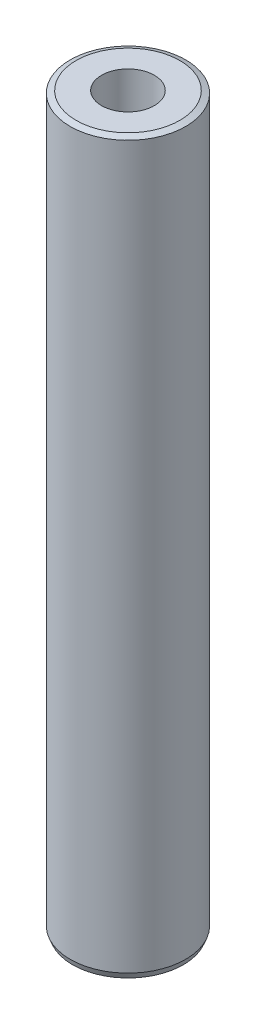
ISO-10303-21;
HEADER;
FILE_DESCRIPTION(('STEP AP214'),'2;1');
FILE_NAME('part.step','',(''),(''),'','','');
FILE_SCHEMA(('AUTOMOTIVE_DESIGN { 1 0 10303 214 1 1 1 1 }'));
ENDSEC;
DATA;
#1=APPLICATION_CONTEXT('core data for automotive mechanical design processes');
#2=APPLICATION_PROTOCOL_DEFINITION('international standard','automotive_design',2000,#1);
#3=PRODUCT_CONTEXT('',#1,'mechanical');
#4=PRODUCT('Part','Part','',(#3));
#5=PRODUCT_RELATED_PRODUCT_CATEGORY('part','',(#4));
#6=PRODUCT_DEFINITION_FORMATION('','',#4);
#7=PRODUCT_DEFINITION_CONTEXT('part definition',#1,'design');
#8=PRODUCT_DEFINITION('design','',#6,#7);
#9=PRODUCT_DEFINITION_SHAPE('','',#8);
#10=(LENGTH_UNIT() NAMED_UNIT(*) SI_UNIT(.MILLI.,.METRE.));
#11=(NAMED_UNIT(*) PLANE_ANGLE_UNIT() SI_UNIT($,.RADIAN.));
#12=(NAMED_UNIT(*) SI_UNIT($,.STERADIAN.) SOLID_ANGLE_UNIT());
#13=UNCERTAINTY_MEASURE_WITH_UNIT(LENGTH_MEASURE(1.E-05),#10,'distance_accuracy_value','');
#14=(GEOMETRIC_REPRESENTATION_CONTEXT(3) GLOBAL_UNCERTAINTY_ASSIGNED_CONTEXT((#13)) GLOBAL_UNIT_ASSIGNED_CONTEXT((#10,
#11,#12)) REPRESENTATION_CONTEXT('',''));
#15=CARTESIAN_POINT('',(0.,0.,0.));
#16=DIRECTION('',(0.,0.,1.));
#17=DIRECTION('',(1.,0.,0.));
#18=AXIS2_PLACEMENT_3D('',#15,#16,#17);
#19=CARTESIAN_POINT('',(0.,600.,0.));
#20=DIRECTION('',(0.,-1.,0.));
#21=DIRECTION('',(0.,0.,-1.));
#22=AXIS2_PLACEMENT_3D('',#19,#20,#21);
#23=CYLINDRICAL_SURFACE('',#22,47.5);
#24=CARTESIAN_POINT('',(0.,598.071272281347,0.));
#25=DIRECTION('',(0.,1.,0.));
#26=DIRECTION('',(0.,0.,1.));
#27=AXIS2_PLACEMENT_3D('',#24,#25,#26);
#28=CIRCLE('',#27,47.5);
#29=CARTESIAN_POINT('',(0.,598.071272281347,47.5));
#30=VERTEX_POINT('',#29);
#31=EDGE_CURVE('E50',#30,#30,#28,.F.);
#32=ORIENTED_EDGE('',*,*,#31,.T.);
#33=EDGE_LOOP('',(#32));
#34=FACE_BOUND('',#33,.T.);
#35=CARTESIAN_POINT('',(0.,4.83887665642557,0.));
#36=DIRECTION('',(0.,1.,0.));
#37=DIRECTION('',(0.,0.,1.));
#38=AXIS2_PLACEMENT_3D('',#35,#36,#37);
#39=CIRCLE('',#38,47.5);
#40=CARTESIAN_POINT('',(0.,4.83887665642557,47.5));
#41=VERTEX_POINT('',#40);
#42=EDGE_CURVE('E51',#41,#41,#39,.T.);
#43=ORIENTED_EDGE('',*,*,#42,.T.);
#44=EDGE_LOOP('',(#43));
#45=FACE_BOUND('',#44,.T.);
#46=ADVANCED_FACE('F39',(#34,#45),#23,.T.);
#47=CARTESIAN_POINT('',(0.,600.,0.));
#48=DIRECTION('',(0.,1.,0.));
#49=DIRECTION('',(0.,0.,1.));
#50=AXIS2_PLACEMENT_3D('',#47,#48,#49);
#51=PLANE('',#50);
#52=CARTESIAN_POINT('',(0.,600.,0.));
#53=DIRECTION('',(0.,1.,0.));
#54=DIRECTION('',(0.,0.,1.));
#55=AXIS2_PLACEMENT_3D('',#52,#53,#54);
#56=CIRCLE('',#55,42.661123343574);
#57=CARTESIAN_POINT('',(0.,600.,42.661123343574));
#58=VERTEX_POINT('',#57);
#59=EDGE_CURVE('E54',#58,#58,#56,.T.);
#60=ORIENTED_EDGE('',*,*,#59,.T.);
#61=EDGE_LOOP('',(#60));
#62=FACE_BOUND('',#61,.T.);
#63=CARTESIAN_POINT('',(0.,600.,0.));
#64=DIRECTION('',(0.,1.,0.));
#65=DIRECTION('',(0.,0.,1.));
#66=AXIS2_PLACEMENT_3D('',#63,#64,#65);
#67=CIRCLE('',#66,21.7029122122501);
#68=CARTESIAN_POINT('',(0.,600.,21.7029122122501));
#69=VERTEX_POINT('',#68);
#70=EDGE_CURVE('E58',#69,#69,#67,.T.);
#71=ORIENTED_EDGE('',*,*,#70,.F.);
#72=EDGE_LOOP('',(#71));
#73=FACE_BOUND('',#72,.T.);
#74=ADVANCED_FACE('F69',(#62,#73),#51,.T.);
#75=CARTESIAN_POINT('',(0.,0.,0.));
#76=DIRECTION('',(0.,1.,0.));
#77=DIRECTION('',(0.,0.,1.));
#78=AXIS2_PLACEMENT_3D('',#75,#76,#77);
#79=PLANE('',#78);
#80=CARTESIAN_POINT('',(0.,0.,0.));
#81=DIRECTION('',(0.,1.,0.));
#82=DIRECTION('',(0.,0.,1.));
#83=AXIS2_PLACEMENT_3D('',#80,#81,#82);
#84=CIRCLE('',#83,45.5712722813468);
#85=CARTESIAN_POINT('',(0.,0.,45.5712722813468));
#86=VERTEX_POINT('',#85);
#87=EDGE_CURVE('E10',#86,#86,#84,.F.);
#88=ORIENTED_EDGE('',*,*,#87,.T.);
#89=EDGE_LOOP('',(#88));
#90=FACE_BOUND('',#89,.T.);
#91=CARTESIAN_POINT('',(0.,0.,0.));
#92=DIRECTION('',(0.,1.,0.));
#93=DIRECTION('',(0.,0.,1.));
#94=AXIS2_PLACEMENT_3D('',#91,#92,#93);
#95=CIRCLE('',#94,21.7029122122501);
#96=CARTESIAN_POINT('',(0.,0.,21.7029122122501));
#97=VERTEX_POINT('',#96);
#98=EDGE_CURVE('E63',#97,#97,#95,.T.);
#99=ORIENTED_EDGE('',*,*,#98,.T.);
#100=EDGE_LOOP('',(#99));
#101=FACE_BOUND('',#100,.T.);
#102=ADVANCED_FACE('F75',(#90,#101),#79,.F.);
#103=CARTESIAN_POINT('',(0.,600.,0.));
#104=DIRECTION('',(0.,-1.,0.));
#105=DIRECTION('',(0.,0.,-1.));
#106=AXIS2_PLACEMENT_3D('',#103,#104,#105);
#107=CYLINDRICAL_SURFACE('',#106,21.7029122122501);
#108=ORIENTED_EDGE('',*,*,#70,.T.);
#109=EDGE_LOOP('',(#108));
#110=FACE_BOUND('',#109,.T.);
#111=ORIENTED_EDGE('',*,*,#98,.F.);
#112=EDGE_LOOP('',(#111));
#113=FACE_BOUND('',#112,.T.);
#114=ADVANCED_FACE('F70',(#110,#113),#107,.F.);
#115=CARTESIAN_POINT('',(0.,600.,0.));
#116=DIRECTION('',(0.,-1.,0.));
#117=DIRECTION('',(0.,0.,-1.));
#118=AXIS2_PLACEMENT_3D('',#115,#116,#117);
#119=CONICAL_SURFACE('',#118,42.661123343574,1.19150608040067);
#120=ORIENTED_EDGE('',*,*,#31,.F.);
#121=EDGE_LOOP('',(#120));
#122=FACE_BOUND('',#121,.T.);
#123=ORIENTED_EDGE('',*,*,#59,.F.);
#124=EDGE_LOOP('',(#123));
#125=FACE_BOUND('',#124,.T.);
#126=ADVANCED_FACE('F81',(#122,#125),#119,.T.);
#127=CARTESIAN_POINT('',(0.,4.83887665642557,0.));
#128=DIRECTION('',(0.,1.,0.));
#129=DIRECTION('',(0.,0.,1.));
#130=AXIS2_PLACEMENT_3D('',#127,#128,#129);
#131=CONICAL_SURFACE('',#130,47.5,0.37929024639423);
#132=ORIENTED_EDGE('',*,*,#87,.F.);
#133=EDGE_LOOP('',(#132));
#134=FACE_BOUND('',#133,.T.);
#135=ORIENTED_EDGE('',*,*,#42,.F.);
#136=EDGE_LOOP('',(#135));
#137=FACE_BOUND('',#136,.T.);
#138=ADVANCED_FACE('F45',(#134,#137),#131,.T.);
#139=CLOSED_SHELL('',(#46,#74,#102,#114,#126,#138));
#140=MANIFOLD_SOLID_BREP('B2',#139);
#141=ADVANCED_BREP_SHAPE_REPRESENTATION('',(#18,#140),#14);
#142=SHAPE_DEFINITION_REPRESENTATION(#9,#141);
ENDSEC;
END-ISO-10303-21;
